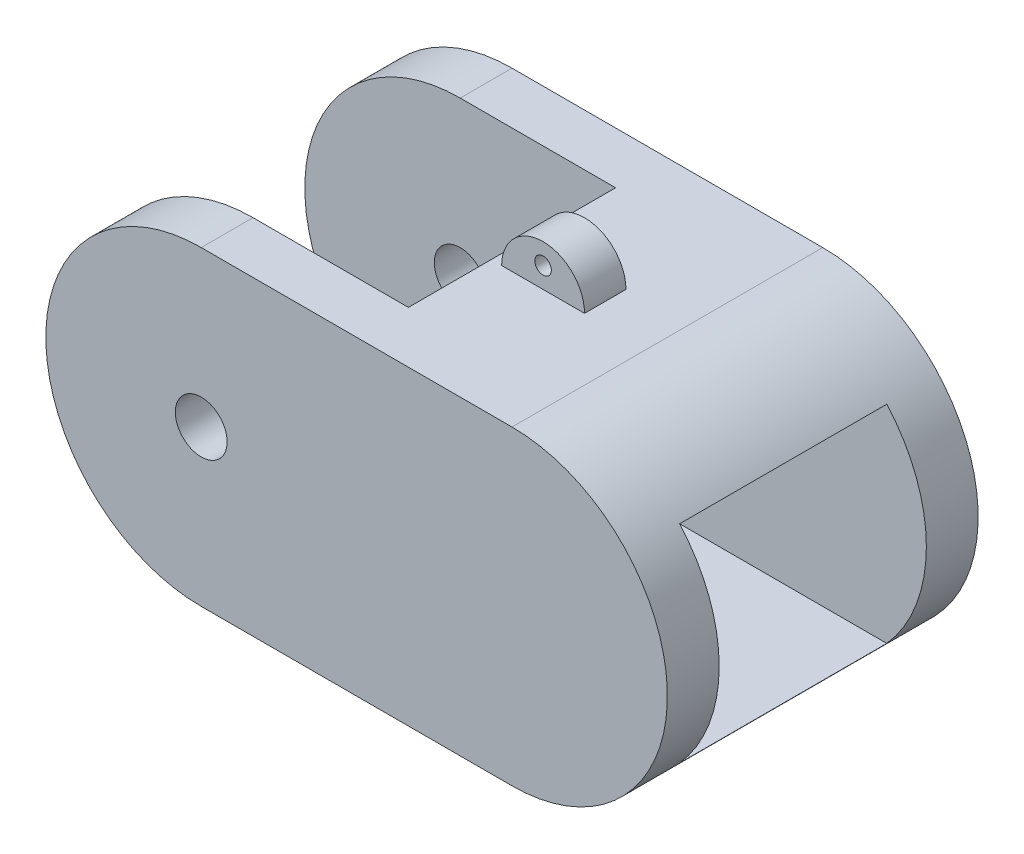
ISO-10303-21;
HEADER;
FILE_DESCRIPTION(('STEP AP214'),'2;1');
FILE_NAME('part.step','',(''),(''),'','','');
FILE_SCHEMA(('AUTOMOTIVE_DESIGN { 1 0 10303 214 1 1 1 1 }'));
ENDSEC;
DATA;
#1=APPLICATION_CONTEXT('core data for automotive mechanical design processes');
#2=APPLICATION_PROTOCOL_DEFINITION('international standard','automotive_design',2000,#1);
#3=PRODUCT_CONTEXT('',#1,'mechanical');
#4=PRODUCT('Part','Part','',(#3));
#5=PRODUCT_RELATED_PRODUCT_CATEGORY('part','',(#4));
#6=PRODUCT_DEFINITION_FORMATION('','',#4);
#7=PRODUCT_DEFINITION_CONTEXT('part definition',#1,'design');
#8=PRODUCT_DEFINITION('design','',#6,#7);
#9=PRODUCT_DEFINITION_SHAPE('','',#8);
#10=(LENGTH_UNIT() NAMED_UNIT(*) SI_UNIT(.MILLI.,.METRE.));
#11=(NAMED_UNIT(*) PLANE_ANGLE_UNIT() SI_UNIT($,.RADIAN.));
#12=(NAMED_UNIT(*) SI_UNIT($,.STERADIAN.) SOLID_ANGLE_UNIT());
#13=UNCERTAINTY_MEASURE_WITH_UNIT(LENGTH_MEASURE(1.E-05),#10,'distance_accuracy_value','');
#14=(GEOMETRIC_REPRESENTATION_CONTEXT(3) GLOBAL_UNCERTAINTY_ASSIGNED_CONTEXT((#13)) GLOBAL_UNIT_ASSIGNED_CONTEXT((#10,
#11,#12)) REPRESENTATION_CONTEXT('',''));
#15=CARTESIAN_POINT('',(0.,0.,0.));
#16=DIRECTION('',(0.,0.,1.));
#17=DIRECTION('',(1.,0.,0.));
#18=AXIS2_PLACEMENT_3D('',#15,#16,#17);
#19=CARTESIAN_POINT('',(-2.54,21.59,1.27));
#20=DIRECTION('',(0.,0.,-1.));
#21=DIRECTION('',(-1.,0.,0.));
#22=AXIS2_PLACEMENT_3D('',#19,#20,#21);
#23=PLANE('',#22);
#24=DIRECTION('',(1.,0.,0.));
#25=VECTOR('',#24,1.);
#26=CARTESIAN_POINT('',(-2.54,19.05,1.27));
#27=LINE('',#26,#25);
#28=CARTESIAN_POINT('',(-2.54,19.05,1.27));
#29=VERTEX_POINT('',#28);
#30=CARTESIAN_POINT('',(2.54,19.05,1.26999999999999));
#31=VERTEX_POINT('',#30);
#32=EDGE_CURVE('E322',#29,#31,#27,.T.);
#33=ORIENTED_EDGE('',*,*,#32,.T.);
#34=CARTESIAN_POINT('',(0.,19.05,1.27));
#35=DIRECTION('',(0.,0.,-1.));
#36=DIRECTION('',(-1.,0.,0.));
#37=AXIS2_PLACEMENT_3D('',#34,#35,#36);
#38=CIRCLE('',#37,2.54);
#39=EDGE_CURVE('E302',#31,#29,#38,.F.);
#40=ORIENTED_EDGE('',*,*,#39,.T.);
#41=EDGE_LOOP('',(#33,#40));
#42=FACE_BOUND('',#41,.T.);
#43=CARTESIAN_POINT('',(0.,20.32,1.27));
#44=DIRECTION('',(0.,0.,-1.));
#45=DIRECTION('',(-1.,0.,0.));
#46=AXIS2_PLACEMENT_3D('',#43,#44,#45);
#47=CIRCLE('',#46,0.508000000000001);
#48=CARTESIAN_POINT('',(-0.508000000000002,20.32,1.27));
#49=VERTEX_POINT('',#48);
#50=EDGE_CURVE('E301',#49,#49,#47,.T.);
#51=ORIENTED_EDGE('',*,*,#50,.T.);
#52=EDGE_LOOP('',(#51));
#53=FACE_BOUND('',#52,.T.);
#54=ADVANCED_FACE('F39',(#42,#53),#23,.F.);
#55=CARTESIAN_POINT('',(-2.54,21.59,-1.27));
#56=DIRECTION('',(0.,0.,1.));
#57=DIRECTION('',(1.,0.,0.));
#58=AXIS2_PLACEMENT_3D('',#55,#56,#57);
#59=PLANE('',#58);
#60=DIRECTION('',(-1.,0.,0.));
#61=VECTOR('',#60,1.);
#62=CARTESIAN_POINT('',(-2.54,19.05,-1.27));
#63=LINE('',#62,#61);
#64=CARTESIAN_POINT('',(2.54,19.05,-1.27));
#65=VERTEX_POINT('',#64);
#66=CARTESIAN_POINT('',(-2.54,19.05,-1.27));
#67=VERTEX_POINT('',#66);
#68=EDGE_CURVE('E327',#65,#67,#63,.T.);
#69=ORIENTED_EDGE('',*,*,#68,.T.);
#70=CARTESIAN_POINT('',(0.,19.05,-1.27));
#71=DIRECTION('',(0.,0.,1.));
#72=DIRECTION('',(1.,0.,0.));
#73=AXIS2_PLACEMENT_3D('',#70,#71,#72);
#74=CIRCLE('',#73,2.54);
#75=EDGE_CURVE('E310',#67,#65,#74,.F.);
#76=ORIENTED_EDGE('',*,*,#75,.T.);
#77=EDGE_LOOP('',(#69,#76));
#78=FACE_BOUND('',#77,.T.);
#79=CARTESIAN_POINT('',(0.,20.32,-1.27));
#80=DIRECTION('',(0.,0.,1.));
#81=DIRECTION('',(1.,0.,0.));
#82=AXIS2_PLACEMENT_3D('',#79,#80,#81);
#83=CIRCLE('',#82,0.508000000000001);
#84=CARTESIAN_POINT('',(0.508000000000001,20.32,-1.27));
#85=VERTEX_POINT('',#84);
#86=EDGE_CURVE('E298',#85,#85,#83,.T.);
#87=ORIENTED_EDGE('',*,*,#86,.T.);
#88=EDGE_LOOP('',(#87));
#89=FACE_BOUND('',#88,.T.);
#90=ADVANCED_FACE('F499',(#78,#89),#59,.F.);
#91=CARTESIAN_POINT('',(0.,19.05,0.));
#92=DIRECTION('',(0.,1.,0.));
#93=DIRECTION('',(0.,0.,1.));
#94=AXIS2_PLACEMENT_3D('',#91,#92,#93);
#95=PLANE('',#94);
#96=DIRECTION('',(-1.,0.,0.));
#97=VECTOR('',#96,1.);
#98=CARTESIAN_POINT('',(-12.7,19.05,-6.35));
#99=LINE('',#98,#97);
#100=CARTESIAN_POINT('',(-3.175,19.05,-6.35));
#101=VERTEX_POINT('',#100);
#102=CARTESIAN_POINT('',(-12.7,19.05,-6.35));
#103=VERTEX_POINT('',#102);
#104=EDGE_CURVE('E466',#101,#103,#99,.T.);
#105=ORIENTED_EDGE('',*,*,#104,.F.);
#106=DIRECTION('',(0.,0.,-1.));
#107=VECTOR('',#106,1.);
#108=CARTESIAN_POINT('',(-3.175,19.05,-6.35));
#109=LINE('',#108,#107);
#110=CARTESIAN_POINT('',(-3.175,19.05,6.34999999999999));
#111=VERTEX_POINT('',#110);
#112=EDGE_CURVE('E197',#111,#101,#109,.T.);
#113=ORIENTED_EDGE('',*,*,#112,.F.);
#114=DIRECTION('',(1.,0.,0.));
#115=VECTOR('',#114,1.);
#116=CARTESIAN_POINT('',(-12.7,19.05,6.34999999999999));
#117=LINE('',#116,#115);
#118=CARTESIAN_POINT('',(-12.7,19.05,6.34999999999999));
#119=VERTEX_POINT('',#118);
#120=EDGE_CURVE('E188',#119,#111,#117,.T.);
#121=ORIENTED_EDGE('',*,*,#120,.F.);
#122=DIRECTION('',(0.,0.,1.));
#123=VECTOR('',#122,1.);
#124=CARTESIAN_POINT('',(-12.7,19.05,-9.525));
#125=LINE('',#124,#123);
#126=CARTESIAN_POINT('',(-12.7,19.05,9.525));
#127=VERTEX_POINT('',#126);
#128=EDGE_CURVE('E194',#119,#127,#125,.T.);
#129=ORIENTED_EDGE('',*,*,#128,.T.);
#130=DIRECTION('',(1.,0.,0.));
#131=VECTOR('',#130,1.);
#132=CARTESIAN_POINT('',(-22.225,19.05,9.525));
#133=LINE('',#132,#131);
#134=CARTESIAN_POINT('',(6.35,19.05,9.525));
#135=VERTEX_POINT('',#134);
#136=EDGE_CURVE('E256',#127,#135,#133,.T.);
#137=ORIENTED_EDGE('',*,*,#136,.T.);
#138=DIRECTION('',(0.,0.,1.));
#139=VECTOR('',#138,1.);
#140=CARTESIAN_POINT('',(6.35,19.05,-9.525));
#141=LINE('',#140,#139);
#142=CARTESIAN_POINT('',(6.35,19.05,-9.525));
#143=VERTEX_POINT('',#142);
#144=EDGE_CURVE('E236',#143,#135,#141,.T.);
#145=ORIENTED_EDGE('',*,*,#144,.F.);
#146=DIRECTION('',(-1.,0.,0.));
#147=VECTOR('',#146,1.);
#148=CARTESIAN_POINT('',(-22.225,19.05,-9.525));
#149=LINE('',#148,#147);
#150=CARTESIAN_POINT('',(-12.7,19.05,-9.525));
#151=VERTEX_POINT('',#150);
#152=EDGE_CURVE('E259',#143,#151,#149,.T.);
#153=ORIENTED_EDGE('',*,*,#152,.T.);
#154=EDGE_CURVE('E219',#151,#103,#125,.T.);
#155=ORIENTED_EDGE('',*,*,#154,.T.);
#156=EDGE_LOOP('',(#105,#113,#121,#129,#137,#145,#153,#155));
#157=FACE_BOUND('',#156,.T.);
#158=ORIENTED_EDGE('',*,*,#32,.F.);
#159=DIRECTION('',(0.,0.,1.));
#160=VECTOR('',#159,1.);
#161=CARTESIAN_POINT('',(-2.54,19.05,-1.27));
#162=LINE('',#161,#160);
#163=EDGE_CURVE('E308',#67,#29,#162,.T.);
#164=ORIENTED_EDGE('',*,*,#163,.F.);
#165=ORIENTED_EDGE('',*,*,#68,.F.);
#166=DIRECTION('',(0.,0.,-1.));
#167=VECTOR('',#166,1.);
#168=CARTESIAN_POINT('',(2.54,19.05,-1.27));
#169=LINE('',#168,#167);
#170=EDGE_CURVE('E62',#31,#65,#169,.T.);
#171=ORIENTED_EDGE('',*,*,#170,.F.);
#172=EDGE_LOOP('',(#158,#164,#165,#171));
#173=FACE_BOUND('',#172,.T.);
#174=ADVANCED_FACE('F191',(#157,#173),#95,.T.);
#175=CARTESIAN_POINT('',(-6.35,-7.62,-1.90500000000001));
#176=DIRECTION('',(0.,0.,-1.));
#177=DIRECTION('',(-1.,0.,0.));
#178=AXIS2_PLACEMENT_3D('',#175,#176,#177);
#179=PLANE('',#178);
#180=CARTESIAN_POINT('',(-0.0861930186881812,-2.99485448456808,-1.90500000000001));
#181=DIRECTION('',(0.,0.,-1.));
#182=DIRECTION('',(-1.,0.,0.));
#183=AXIS2_PLACEMENT_3D('',#180,#181,#182);
#184=CIRCLE('',#183,4.34412957457592);
#185=CARTESIAN_POINT('',(-4.41362492439032,-2.614335283717,-1.90500000000002));
#186=VERTEX_POINT('',#185);
#187=CARTESIAN_POINT('',(-3.23298636699812,0.,-1.90500000000002));
#188=VERTEX_POINT('',#187);
#189=EDGE_CURVE('E367',#186,#188,#184,.T.);
#190=ORIENTED_EDGE('',*,*,#189,.F.);
#191=CARTESIAN_POINT('',(-2.26854868254507,-2.28495035036065,-1.90500000000001));
#192=DIRECTION('',(0.,0.,-1.));
#193=DIRECTION('',(-1.,0.,0.));
#194=AXIS2_PLACEMENT_3D('',#191,#192,#193);
#195=CIRCLE('',#194,2.17021808066635);
#196=CARTESIAN_POINT('',(-3.04450374837902,-4.31170644162021,-1.90500000000002));
#197=VERTEX_POINT('',#196);
#198=EDGE_CURVE('E370',#197,#186,#195,.T.);
#199=ORIENTED_EDGE('',*,*,#198,.F.);
#200=CARTESIAN_POINT('',(-3.3233412187691,-2.19000144979784,-1.90500000000001));
#201=DIRECTION('',(0.,0.,-1.));
#202=DIRECTION('',(-1.,0.,0.));
#203=AXIS2_PLACEMENT_3D('',#200,#201,#202);
#204=CIRCLE('',#203,2.13994915996094);
#205=CARTESIAN_POINT('',(-1.31460402965717,-2.92780719136958,-1.90500000000002));
#206=VERTEX_POINT('',#205);
#207=EDGE_CURVE('E373',#206,#197,#204,.T.);
#208=ORIENTED_EDGE('',*,*,#207,.F.);
#209=CARTESIAN_POINT('',(-1.96109230852822,-2.92882586705521,-1.90500000000001));
#210=DIRECTION('',(0.,0.,-1.));
#211=DIRECTION('',(-1.,0.,0.));
#212=AXIS2_PLACEMENT_3D('',#209,#210,#211);
#213=CIRCLE('',#212,0.646489081437423);
#214=CARTESIAN_POINT('',(-2.21183198517268,-2.33294186242509,-1.90500000000002));
#215=VERTEX_POINT('',#214);
#216=EDGE_CURVE('E376',#215,#206,#213,.T.);
#217=ORIENTED_EDGE('',*,*,#216,.F.);
#218=CARTESIAN_POINT('',(-2.0593410105954,-1.72984424301921,-1.90500000000001));
#219=DIRECTION('',(0.,0.,-1.));
#220=DIRECTION('',(-1.,0.,0.));
#221=AXIS2_PLACEMENT_3D('',#218,#219,#220);
#222=CIRCLE('',#221,0.622077355206385);
#223=CARTESIAN_POINT('',(-1.90685003601812,-1.12674662361332,-1.90500000000002));
#224=VERTEX_POINT('',#223);
#225=EDGE_CURVE('E379',#224,#215,#222,.F.);
#226=ORIENTED_EDGE('',*,*,#225,.F.);
#227=CARTESIAN_POINT('',(-1.81149307872842,-2.77193940872848,-1.90500000000001));
#228=DIRECTION('',(0.,0.,-1.));
#229=DIRECTION('',(-1.,0.,0.));
#230=AXIS2_PLACEMENT_3D('',#227,#228,#229);
#231=CIRCLE('',#230,1.64795395854936);
#232=CARTESIAN_POINT('',(-0.163539125899153,-2.77180210276902,-1.90500000000002));
#233=VERTEX_POINT('',#232);
#234=EDGE_CURVE('E382',#233,#224,#231,.F.);
#235=ORIENTED_EDGE('',*,*,#234,.F.);
#236=CARTESIAN_POINT('',(-3.15358954399178,-2.81445182249442,-1.90500000000001));
#237=DIRECTION('',(0.,0.,-1.));
#238=DIRECTION('',(-1.,0.,0.));
#239=AXIS2_PLACEMENT_3D('',#236,#237,#238);
#240=CIRCLE('',#239,2.99035457786005);
#241=CARTESIAN_POINT('',(-6.12706480359468,-3.13172990534612,-1.90500000000002));
#242=VERTEX_POINT('',#241);
#243=EDGE_CURVE('E336',#242,#233,#240,.F.);
#244=ORIENTED_EDGE('',*,*,#243,.F.);
#245=DIRECTION('',(0.0710062762211976,-0.997475868749314,0.));
#246=VECTOR('',#245,1.);
#247=CARTESIAN_POINT('',(-5.81029790139981,-7.58158078857746,-1.90500000000001));
#248=LINE('',#247,#246);
#249=CARTESIAN_POINT('',(-6.35,0.,-1.90500000000002));
#250=VERTEX_POINT('',#249);
#251=EDGE_CURVE('E364',#250,#242,#248,.T.);
#252=ORIENTED_EDGE('',*,*,#251,.F.);
#253=DIRECTION('',(-1.,0.,0.));
#254=VECTOR('',#253,1.);
#255=CARTESIAN_POINT('',(-6.35,0.,-1.90500000000001));
#256=LINE('',#255,#254);
#257=EDGE_CURVE('E393',#188,#250,#256,.T.);
#258=ORIENTED_EDGE('',*,*,#257,.F.);
#259=EDGE_LOOP('',(#190,#199,#208,#217,#226,#235,#244,#252,#258));
#260=FACE_BOUND('',#259,.T.);
#261=ADVANCED_FACE('F541',(#260),#179,.T.);
#262=CARTESIAN_POINT('',(-6.35,-7.62,1.90499999999999));
#263=DIRECTION('',(0.,0.,1.));
#264=DIRECTION('',(1.,0.,0.));
#265=AXIS2_PLACEMENT_3D('',#262,#263,#264);
#266=PLANE('',#265);
#267=CARTESIAN_POINT('',(-0.0861930186881812,-2.99485448456808,1.90499999999998));
#268=DIRECTION('',(0.,0.,1.));
#269=DIRECTION('',(1.,0.,0.));
#270=AXIS2_PLACEMENT_3D('',#267,#268,#269);
#271=CIRCLE('',#270,4.34412957457592);
#272=CARTESIAN_POINT('',(-3.23298636699812,0.,1.90499999999998));
#273=VERTEX_POINT('',#272);
#274=CARTESIAN_POINT('',(-4.41362492439032,-2.614335283717,1.90499999999998));
#275=VERTEX_POINT('',#274);
#276=EDGE_CURVE('E48',#273,#275,#271,.T.);
#277=ORIENTED_EDGE('',*,*,#276,.F.);
#278=DIRECTION('',(1.,0.,0.));
#279=VECTOR('',#278,1.);
#280=CARTESIAN_POINT('',(-6.35,0.,1.90499999999999));
#281=LINE('',#280,#279);
#282=CARTESIAN_POINT('',(-6.35,0.,1.90499999999998));
#283=VERTEX_POINT('',#282);
#284=EDGE_CURVE('E389',#283,#273,#281,.T.);
#285=ORIENTED_EDGE('',*,*,#284,.F.);
#286=DIRECTION('',(-0.0710062762211976,0.997475868749314,0.));
#287=VECTOR('',#286,1.);
#288=CARTESIAN_POINT('',(-5.81029790139981,-7.58158078857746,1.90499999999999));
#289=LINE('',#288,#287);
#290=CARTESIAN_POINT('',(-6.12706480359468,-3.13172990534612,1.90499999999998));
#291=VERTEX_POINT('',#290);
#292=EDGE_CURVE('E278',#291,#283,#289,.T.);
#293=ORIENTED_EDGE('',*,*,#292,.F.);
#294=CARTESIAN_POINT('',(-3.15358954399178,-2.81445182249442,1.90499999999998));
#295=DIRECTION('',(0.,0.,1.));
#296=DIRECTION('',(1.,0.,0.));
#297=AXIS2_PLACEMENT_3D('',#294,#295,#296);
#298=CIRCLE('',#297,2.99035457786005);
#299=CARTESIAN_POINT('',(-0.163539125899152,-2.77180210276902,1.90499999999998));
#300=VERTEX_POINT('',#299);
#301=EDGE_CURVE('E275',#300,#291,#298,.F.);
#302=ORIENTED_EDGE('',*,*,#301,.F.);
#303=CARTESIAN_POINT('',(-1.81149307872842,-2.77193940872848,1.90499999999998));
#304=DIRECTION('',(0.,0.,1.));
#305=DIRECTION('',(1.,0.,0.));
#306=AXIS2_PLACEMENT_3D('',#303,#304,#305);
#307=CIRCLE('',#306,1.64795395854936);
#308=CARTESIAN_POINT('',(-1.90685003601812,-1.12674662361332,1.90499999999998));
#309=VERTEX_POINT('',#308);
#310=EDGE_CURVE('E281',#309,#300,#307,.F.);
#311=ORIENTED_EDGE('',*,*,#310,.F.);
#312=CARTESIAN_POINT('',(-2.0593410105954,-1.72984424301921,1.90499999999998));
#313=DIRECTION('',(0.,0.,1.));
#314=DIRECTION('',(1.,0.,0.));
#315=AXIS2_PLACEMENT_3D('',#312,#313,#314);
#316=CIRCLE('',#315,0.622077355206385);
#317=CARTESIAN_POINT('',(-2.21183198517268,-2.33294186242509,1.90499999999998));
#318=VERTEX_POINT('',#317);
#319=EDGE_CURVE('E285',#318,#309,#316,.F.);
#320=ORIENTED_EDGE('',*,*,#319,.F.);
#321=CARTESIAN_POINT('',(-1.96109230852822,-2.92882586705521,1.90499999999998));
#322=DIRECTION('',(0.,0.,1.));
#323=DIRECTION('',(1.,0.,0.));
#324=AXIS2_PLACEMENT_3D('',#321,#322,#323);
#325=CIRCLE('',#324,0.646489081437423);
#326=CARTESIAN_POINT('',(-1.31460402965717,-2.92780719136958,1.90499999999998));
#327=VERTEX_POINT('',#326);
#328=EDGE_CURVE('E288',#327,#318,#325,.T.);
#329=ORIENTED_EDGE('',*,*,#328,.F.);
#330=CARTESIAN_POINT('',(-3.3233412187691,-2.19000144979784,1.90499999999998));
#331=DIRECTION('',(0.,0.,1.));
#332=DIRECTION('',(1.,0.,0.));
#333=AXIS2_PLACEMENT_3D('',#330,#331,#332);
#334=CIRCLE('',#333,2.13994915996094);
#335=CARTESIAN_POINT('',(-3.04450374837902,-4.31170644162021,1.90499999999998));
#336=VERTEX_POINT('',#335);
#337=EDGE_CURVE('E291',#336,#327,#334,.T.);
#338=ORIENTED_EDGE('',*,*,#337,.F.);
#339=CARTESIAN_POINT('',(-2.26854868254507,-2.28495035036065,1.90499999999998));
#340=DIRECTION('',(0.,0.,1.));
#341=DIRECTION('',(1.,0.,0.));
#342=AXIS2_PLACEMENT_3D('',#339,#340,#341);
#343=CIRCLE('',#342,2.17021808066635);
#344=EDGE_CURVE('E294',#275,#336,#343,.T.);
#345=ORIENTED_EDGE('',*,*,#344,.F.);
#346=EDGE_LOOP('',(#277,#285,#293,#302,#311,#320,#329,#338,#345));
#347=FACE_BOUND('',#346,.T.);
#348=ADVANCED_FACE('F544',(#347),#266,.T.);
#349=CARTESIAN_POINT('',(6.35,9.525,-9.525));
#350=DIRECTION('',(0.,0.,1.));
#351=DIRECTION('',(1.,0.,0.));
#352=AXIS2_PLACEMENT_3D('',#349,#350,#351);
#353=CYLINDRICAL_SURFACE('',#352,9.525);
#354=CARTESIAN_POINT('',(6.35,9.525,9.525));
#355=DIRECTION('',(0.,0.,-1.));
#356=DIRECTION('',(1.,0.,0.));
#357=AXIS2_PLACEMENT_3D('',#354,#355,#356);
#358=CIRCLE('',#357,9.525);
#359=CARTESIAN_POINT('',(6.35,0.,9.525));
#360=VERTEX_POINT('',#359);
#361=EDGE_CURVE('E237',#135,#360,#358,.T.);
#362=ORIENTED_EDGE('',*,*,#361,.T.);
#363=DIRECTION('',(0.,0.,1.));
#364=VECTOR('',#363,1.);
#365=CARTESIAN_POINT('',(6.35,0.,-9.525));
#366=LINE('',#365,#364);
#367=CARTESIAN_POINT('',(6.35,0.,-9.525));
#368=VERTEX_POINT('',#367);
#369=EDGE_CURVE('E241',#368,#360,#366,.T.);
#370=ORIENTED_EDGE('',*,*,#369,.F.);
#371=CARTESIAN_POINT('',(6.35,9.525,-9.525));
#372=DIRECTION('',(0.,0.,-1.));
#373=DIRECTION('',(1.,0.,0.));
#374=AXIS2_PLACEMENT_3D('',#371,#372,#373);
#375=CIRCLE('',#374,9.525);
#376=EDGE_CURVE('E232',#143,#368,#375,.T.);
#377=ORIENTED_EDGE('',*,*,#376,.F.);
#378=ORIENTED_EDGE('',*,*,#144,.T.);
#379=EDGE_LOOP('',(#362,#370,#377,#378));
#380=FACE_BOUND('',#379,.T.);
#381=CARTESIAN_POINT('',(6.35,9.525,-6.35));
#382=DIRECTION('',(0.,0.,1.));
#383=DIRECTION('',(0.,-1.,0.));
#384=AXIS2_PLACEMENT_3D('',#381,#382,#383);
#385=CIRCLE('',#384,9.525);
#386=CARTESIAN_POINT('',(13.4495158285618,3.175,-6.35));
#387=VERTEX_POINT('',#386);
#388=CARTESIAN_POINT('',(13.4495158285618,15.875,-6.35));
#389=VERTEX_POINT('',#388);
#390=EDGE_CURVE('E424',#387,#389,#385,.T.);
#391=ORIENTED_EDGE('',*,*,#390,.F.);
#392=DIRECTION('',(0.,0.,1.));
#393=VECTOR('',#392,1.);
#394=CARTESIAN_POINT('',(13.4495158285618,3.175,-9.525));
#395=LINE('',#394,#393);
#396=CARTESIAN_POINT('',(13.4495158285618,3.175,6.35));
#397=VERTEX_POINT('',#396);
#398=EDGE_CURVE('E414',#397,#387,#395,.F.);
#399=ORIENTED_EDGE('',*,*,#398,.F.);
#400=CARTESIAN_POINT('',(6.35,9.525,6.35));
#401=DIRECTION('',(0.,0.,-1.));
#402=DIRECTION('',(-1.,0.,0.));
#403=AXIS2_PLACEMENT_3D('',#400,#401,#402);
#404=CIRCLE('',#403,9.525);
#405=CARTESIAN_POINT('',(13.4495158285618,15.875,6.35));
#406=VERTEX_POINT('',#405);
#407=EDGE_CURVE('E420',#406,#397,#404,.T.);
#408=ORIENTED_EDGE('',*,*,#407,.F.);
#409=DIRECTION('',(0.,0.,1.));
#410=VECTOR('',#409,1.);
#411=CARTESIAN_POINT('',(13.4495158285618,15.875,-9.525));
#412=LINE('',#411,#410);
#413=EDGE_CURVE('E417',#389,#406,#412,.T.);
#414=ORIENTED_EDGE('',*,*,#413,.F.);
#415=EDGE_LOOP('',(#391,#399,#408,#414));
#416=FACE_BOUND('',#415,.T.);
#417=ADVANCED_FACE('F454',(#380,#416),#353,.T.);
#418=CARTESIAN_POINT('',(-12.7,9.525,-9.525));
#419=DIRECTION('',(0.,0.,1.));
#420=DIRECTION('',(1.,0.,0.));
#421=AXIS2_PLACEMENT_3D('',#418,#419,#420);
#422=CYLINDRICAL_SURFACE('',#421,1.5875);
#423=CARTESIAN_POINT('',(-12.7,9.525,-9.525));
#424=DIRECTION('',(0.,0.,1.));
#425=DIRECTION('',(1.,0.,0.));
#426=AXIS2_PLACEMENT_3D('',#423,#424,#425);
#427=CIRCLE('',#426,1.5875);
#428=CARTESIAN_POINT('',(-11.1125,9.525,-9.525));
#429=VERTEX_POINT('',#428);
#430=EDGE_CURVE('E248',#429,#429,#427,.T.);
#431=ORIENTED_EDGE('',*,*,#430,.F.);
#432=EDGE_LOOP('',(#431));
#433=FACE_BOUND('',#432,.T.);
#434=CARTESIAN_POINT('',(-12.7,9.525,-6.35));
#435=DIRECTION('',(0.,0.,-1.));
#436=DIRECTION('',(-1.,0.,0.));
#437=AXIS2_PLACEMENT_3D('',#434,#435,#436);
#438=CIRCLE('',#437,1.5875);
#439=CARTESIAN_POINT('',(-14.2875,9.525,-6.35));
#440=VERTEX_POINT('',#439);
#441=EDGE_CURVE('E271',#440,#440,#438,.F.);
#442=ORIENTED_EDGE('',*,*,#441,.T.);
#443=EDGE_LOOP('',(#442));
#444=FACE_BOUND('',#443,.T.);
#445=ADVANCED_FACE('F564',(#433,#444),#422,.F.);
#446=CARTESIAN_POINT('',(-12.7,9.525,9.525));
#447=DIRECTION('',(0.,0.,1.));
#448=DIRECTION('',(1.,0.,0.));
#449=AXIS2_PLACEMENT_3D('',#446,#447,#448);
#450=CIRCLE('',#449,1.5875);
#451=CARTESIAN_POINT('',(-11.1125,9.525,9.525));
#452=VERTEX_POINT('',#451);
#453=EDGE_CURVE('E225',#452,#452,#450,.T.);
#454=ORIENTED_EDGE('',*,*,#453,.T.);
#455=EDGE_LOOP('',(#454));
#456=FACE_BOUND('',#455,.T.);
#457=CARTESIAN_POINT('',(-12.7,9.525,6.35));
#458=DIRECTION('',(0.,0.,1.));
#459=DIRECTION('',(1.,0.,0.));
#460=AXIS2_PLACEMENT_3D('',#457,#458,#459);
#461=CIRCLE('',#460,1.5875);
#462=CARTESIAN_POINT('',(-11.1125,9.525,6.35));
#463=VERTEX_POINT('',#462);
#464=EDGE_CURVE('E263',#463,#463,#461,.F.);
#465=ORIENTED_EDGE('',*,*,#464,.T.);
#466=EDGE_LOOP('',(#465));
#467=FACE_BOUND('',#466,.T.);
#468=ADVANCED_FACE('F557',(#456,#467),#422,.F.);
#469=CARTESIAN_POINT('',(-12.7,0.,-6.35));
#470=DIRECTION('',(1.,0.,0.));
#471=DIRECTION('',(0.,0.,-1.));
#472=AXIS2_PLACEMENT_3D('',#469,#470,#471);
#473=PLANE('',#472);
#474=DIRECTION('',(0.,0.,1.));
#475=VECTOR('',#474,1.);
#476=CARTESIAN_POINT('',(-12.7,3.175,-6.35));
#477=LINE('',#476,#475);
#478=CARTESIAN_POINT('',(-12.7,3.175,-6.35));
#479=VERTEX_POINT('',#478);
#480=CARTESIAN_POINT('',(-12.7,3.175,6.35));
#481=VERTEX_POINT('',#480);
#482=EDGE_CURVE('E411',#479,#481,#477,.T.);
#483=ORIENTED_EDGE('',*,*,#482,.F.);
#484=DIRECTION('',(0.,1.,0.));
#485=VECTOR('',#484,1.);
#486=CARTESIAN_POINT('',(-12.7,0.,-6.35));
#487=LINE('',#486,#485);
#488=CARTESIAN_POINT('',(-12.7,0.,-6.35));
#489=VERTEX_POINT('',#488);
#490=EDGE_CURVE('E212',#489,#479,#487,.T.);
#491=ORIENTED_EDGE('',*,*,#490,.F.);
#492=DIRECTION('',(0.,0.,-1.));
#493=VECTOR('',#492,1.);
#494=CARTESIAN_POINT('',(-12.7,0.,-6.35));
#495=LINE('',#494,#493);
#496=CARTESIAN_POINT('',(-12.7,0.,6.35));
#497=VERTEX_POINT('',#496);
#498=EDGE_CURVE('E427',#497,#489,#495,.T.);
#499=ORIENTED_EDGE('',*,*,#498,.F.);
#500=DIRECTION('',(0.,1.,0.));
#501=VECTOR('',#500,1.);
#502=CARTESIAN_POINT('',(-12.7,0.,6.35));
#503=LINE('',#502,#501);
#504=EDGE_CURVE('E206',#497,#481,#503,.T.);
#505=ORIENTED_EDGE('',*,*,#504,.T.);
#506=EDGE_LOOP('',(#483,#491,#499,#505));
#507=FACE_BOUND('',#506,.T.);
#508=ADVANCED_FACE('F469',(#507),#473,.F.);
#509=CARTESIAN_POINT('',(-12.7,9.525,-9.525));
#510=DIRECTION('',(0.,0.,1.));
#511=DIRECTION('',(1.,0.,0.));
#512=AXIS2_PLACEMENT_3D('',#509,#510,#511);
#513=CYLINDRICAL_SURFACE('',#512,9.525);
#514=DIRECTION('',(0.,0.,1.));
#515=VECTOR('',#514,1.);
#516=CARTESIAN_POINT('',(-12.7,0.,-9.525));
#517=LINE('',#516,#515);
#518=CARTESIAN_POINT('',(-12.7,0.,-9.525));
#519=VERTEX_POINT('',#518);
#520=EDGE_CURVE('E220',#519,#489,#517,.T.);
#521=ORIENTED_EDGE('',*,*,#520,.T.);
#522=CARTESIAN_POINT('',(-12.7,9.525,-6.35));
#523=DIRECTION('',(0.,0.,-1.));
#524=DIRECTION('',(-1.,0.,0.));
#525=AXIS2_PLACEMENT_3D('',#522,#523,#524);
#526=CIRCLE('',#525,9.525);
#527=EDGE_CURVE('E211',#489,#103,#526,.T.);
#528=ORIENTED_EDGE('',*,*,#527,.T.);
#529=ORIENTED_EDGE('',*,*,#154,.F.);
#530=CARTESIAN_POINT('',(-12.7,9.525,-9.525));
#531=DIRECTION('',(0.,0.,-1.));
#532=DIRECTION('',(1.,0.,0.));
#533=AXIS2_PLACEMENT_3D('',#530,#531,#532);
#534=CIRCLE('',#533,9.525);
#535=EDGE_CURVE('E438',#519,#151,#534,.T.);
#536=ORIENTED_EDGE('',*,*,#535,.F.);
#537=EDGE_LOOP('',(#521,#528,#529,#536));
#538=FACE_BOUND('',#537,.T.);
#539=ADVANCED_FACE('F460',(#538),#513,.T.);
#540=CARTESIAN_POINT('',(0.,0.,0.));
#541=DIRECTION('',(0.,1.,0.));
#542=DIRECTION('',(0.,0.,1.));
#543=AXIS2_PLACEMENT_3D('',#540,#541,#542);
#544=PLANE('',#543);
#545=DIRECTION('',(0.,0.,1.));
#546=VECTOR('',#545,1.);
#547=CARTESIAN_POINT('',(-3.23298636699812,0.,-9.525));
#548=LINE('',#547,#546);
#549=EDGE_CURVE('E353',#188,#273,#548,.T.);
#550=ORIENTED_EDGE('',*,*,#549,.F.);
#551=ORIENTED_EDGE('',*,*,#257,.T.);
#552=DIRECTION('',(0.,0.,1.));
#553=VECTOR('',#552,1.);
#554=CARTESIAN_POINT('',(-6.35,0.,1.90499999999999));
#555=LINE('',#554,#553);
#556=EDGE_CURVE('E385',#250,#283,#555,.T.);
#557=ORIENTED_EDGE('',*,*,#556,.T.);
#558=ORIENTED_EDGE('',*,*,#284,.T.);
#559=EDGE_LOOP('',(#550,#551,#557,#558));
#560=FACE_BOUND('',#559,.T.);
#561=ORIENTED_EDGE('',*,*,#369,.T.);
#562=DIRECTION('',(1.,0.,0.));
#563=VECTOR('',#562,1.);
#564=CARTESIAN_POINT('',(-22.225,0.,9.525));
#565=LINE('',#564,#563);
#566=CARTESIAN_POINT('',(-12.7,0.,9.525));
#567=VERTEX_POINT('',#566);
#568=EDGE_CURVE('E252',#567,#360,#565,.T.);
#569=ORIENTED_EDGE('',*,*,#568,.F.);
#570=EDGE_CURVE('E227',#497,#567,#517,.T.);
#571=ORIENTED_EDGE('',*,*,#570,.F.);
#572=ORIENTED_EDGE('',*,*,#498,.T.);
#573=ORIENTED_EDGE('',*,*,#520,.F.);
#574=DIRECTION('',(-1.,0.,0.));
#575=VECTOR('',#574,1.);
#576=CARTESIAN_POINT('',(-22.225,0.,-9.525));
#577=LINE('',#576,#575);
#578=EDGE_CURVE('E260',#368,#519,#577,.T.);
#579=ORIENTED_EDGE('',*,*,#578,.F.);
#580=EDGE_LOOP('',(#561,#569,#571,#572,#573,#579));
#581=FACE_BOUND('',#580,.T.);
#582=ADVANCED_FACE('F450',(#560,#581),#544,.F.);
#583=CARTESIAN_POINT('',(-22.225,19.05,9.525));
#584=DIRECTION('',(0.,0.,-1.));
#585=DIRECTION('',(-1.,0.,0.));
#586=AXIS2_PLACEMENT_3D('',#583,#584,#585);
#587=PLANE('',#586);
#588=ORIENTED_EDGE('',*,*,#453,.F.);
#589=EDGE_LOOP('',(#588));
#590=FACE_BOUND('',#589,.T.);
#591=ORIENTED_EDGE('',*,*,#568,.T.);
#592=ORIENTED_EDGE('',*,*,#361,.F.);
#593=ORIENTED_EDGE('',*,*,#136,.F.);
#594=CARTESIAN_POINT('',(-12.7,9.525,9.525));
#595=DIRECTION('',(0.,0.,-1.));
#596=DIRECTION('',(1.,0.,0.));
#597=AXIS2_PLACEMENT_3D('',#594,#595,#596);
#598=CIRCLE('',#597,9.525);
#599=EDGE_CURVE('E216',#567,#127,#598,.T.);
#600=ORIENTED_EDGE('',*,*,#599,.F.);
#601=EDGE_LOOP('',(#591,#592,#593,#600));
#602=FACE_BOUND('',#601,.T.);
#603=ADVANCED_FACE('F41',(#590,#602),#587,.F.);
#604=CARTESIAN_POINT('',(-22.225,19.05,-9.525));
#605=DIRECTION('',(0.,0.,1.));
#606=DIRECTION('',(1.,0.,0.));
#607=AXIS2_PLACEMENT_3D('',#604,#605,#606);
#608=PLANE('',#607);
#609=ORIENTED_EDGE('',*,*,#430,.T.);
#610=EDGE_LOOP('',(#609));
#611=FACE_BOUND('',#610,.T.);
#612=ORIENTED_EDGE('',*,*,#152,.F.);
#613=ORIENTED_EDGE('',*,*,#376,.T.);
#614=ORIENTED_EDGE('',*,*,#578,.T.);
#615=ORIENTED_EDGE('',*,*,#535,.T.);
#616=EDGE_LOOP('',(#612,#613,#614,#615));
#617=FACE_BOUND('',#616,.T.);
#618=ADVANCED_FACE('F457',(#611,#617),#608,.F.);
#619=ORIENTED_EDGE('',*,*,#128,.F.);
#620=CARTESIAN_POINT('',(-12.7,9.525,6.35));
#621=DIRECTION('',(0.,0.,1.));
#622=DIRECTION('',(1.,0.,0.));
#623=AXIS2_PLACEMENT_3D('',#620,#621,#622);
#624=CIRCLE('',#623,9.525);
#625=EDGE_CURVE('E201',#119,#497,#624,.T.);
#626=ORIENTED_EDGE('',*,*,#625,.T.);
#627=ORIENTED_EDGE('',*,*,#570,.T.);
#628=ORIENTED_EDGE('',*,*,#599,.T.);
#629=EDGE_LOOP('',(#619,#626,#627,#628));
#630=FACE_BOUND('',#629,.T.);
#631=ADVANCED_FACE('F214',(#630),#513,.T.);
#632=CARTESIAN_POINT('',(-29.3200702227345,0.,-6.35));
#633=DIRECTION('',(0.,0.,-1.));
#634=DIRECTION('',(-1.,0.,0.));
#635=AXIS2_PLACEMENT_3D('',#632,#633,#634);
#636=PLANE('',#635);
#637=ORIENTED_EDGE('',*,*,#104,.T.);
#638=ORIENTED_EDGE('',*,*,#527,.F.);
#639=ORIENTED_EDGE('',*,*,#490,.T.);
#640=DIRECTION('',(-1.,0.,0.));
#641=VECTOR('',#640,1.);
#642=CARTESIAN_POINT('',(34.925,3.175,-6.35));
#643=LINE('',#642,#641);
#644=EDGE_CURVE('E397',#387,#479,#643,.T.);
#645=ORIENTED_EDGE('',*,*,#644,.F.);
#646=ORIENTED_EDGE('',*,*,#390,.T.);
#647=DIRECTION('',(-1.,0.,0.));
#648=VECTOR('',#647,1.);
#649=CARTESIAN_POINT('',(34.925,15.875,-6.35));
#650=LINE('',#649,#648);
#651=CARTESIAN_POINT('',(-3.175,15.875,-6.35));
#652=VERTEX_POINT('',#651);
#653=EDGE_CURVE('E407',#389,#652,#650,.T.);
#654=ORIENTED_EDGE('',*,*,#653,.T.);
#655=DIRECTION('',(0.,1.,0.));
#656=VECTOR('',#655,1.);
#657=CARTESIAN_POINT('',(-3.175,15.24,-6.35));
#658=LINE('',#657,#656);
#659=EDGE_CURVE('E316',#652,#101,#658,.T.);
#660=ORIENTED_EDGE('',*,*,#659,.T.);
#661=EDGE_LOOP('',(#637,#638,#639,#645,#646,#654,#660));
#662=FACE_BOUND('',#661,.T.);
#663=ORIENTED_EDGE('',*,*,#441,.F.);
#664=EDGE_LOOP('',(#663));
#665=FACE_BOUND('',#664,.T.);
#666=ADVANCED_FACE('F463',(#662,#665),#636,.F.);
#667=CARTESIAN_POINT('',(-29.3200702227345,0.,6.35));
#668=DIRECTION('',(0.,0.,1.));
#669=DIRECTION('',(1.,0.,0.));
#670=AXIS2_PLACEMENT_3D('',#667,#668,#669);
#671=PLANE('',#670);
#672=ORIENTED_EDGE('',*,*,#625,.F.);
#673=ORIENTED_EDGE('',*,*,#120,.T.);
#674=DIRECTION('',(0.,1.,0.));
#675=VECTOR('',#674,1.);
#676=CARTESIAN_POINT('',(-3.175,15.24,6.34999999999999));
#677=LINE('',#676,#675);
#678=CARTESIAN_POINT('',(-3.175,15.875,6.35));
#679=VERTEX_POINT('',#678);
#680=EDGE_CURVE('E55',#679,#111,#677,.T.);
#681=ORIENTED_EDGE('',*,*,#680,.F.);
#682=DIRECTION('',(-1.,0.,0.));
#683=VECTOR('',#682,1.);
#684=CARTESIAN_POINT('',(34.925,15.875,6.35));
#685=LINE('',#684,#683);
#686=EDGE_CURVE('E403',#406,#679,#685,.T.);
#687=ORIENTED_EDGE('',*,*,#686,.F.);
#688=ORIENTED_EDGE('',*,*,#407,.T.);
#689=DIRECTION('',(-1.,0.,0.));
#690=VECTOR('',#689,1.);
#691=CARTESIAN_POINT('',(34.925,3.175,6.35));
#692=LINE('',#691,#690);
#693=EDGE_CURVE('E400',#397,#481,#692,.T.);
#694=ORIENTED_EDGE('',*,*,#693,.T.);
#695=ORIENTED_EDGE('',*,*,#504,.F.);
#696=EDGE_LOOP('',(#672,#673,#681,#687,#688,#694,#695));
#697=FACE_BOUND('',#696,.T.);
#698=ORIENTED_EDGE('',*,*,#464,.F.);
#699=EDGE_LOOP('',(#698));
#700=FACE_BOUND('',#699,.T.);
#701=ADVANCED_FACE('F202',(#697,#700),#671,.F.);
#702=CARTESIAN_POINT('',(34.925,15.875,-6.35));
#703=DIRECTION('',(0.,-1.,0.));
#704=DIRECTION('',(0.,0.,-1.));
#705=AXIS2_PLACEMENT_3D('',#702,#703,#704);
#706=PLANE('',#705);
#707=DIRECTION('',(0.,0.,1.));
#708=VECTOR('',#707,1.);
#709=CARTESIAN_POINT('',(-3.175,15.875,-6.35));
#710=LINE('',#709,#708);
#711=EDGE_CURVE('E11',#652,#679,#710,.T.);
#712=ORIENTED_EDGE('',*,*,#711,.F.);
#713=ORIENTED_EDGE('',*,*,#653,.F.);
#714=ORIENTED_EDGE('',*,*,#413,.T.);
#715=ORIENTED_EDGE('',*,*,#686,.T.);
#716=EDGE_LOOP('',(#712,#713,#714,#715));
#717=FACE_BOUND('',#716,.T.);
#718=ADVANCED_FACE('F479',(#717),#706,.T.);
#719=CARTESIAN_POINT('',(34.925,3.175,-6.35));
#720=DIRECTION('',(0.,1.,0.));
#721=DIRECTION('',(0.,0.,1.));
#722=AXIS2_PLACEMENT_3D('',#719,#720,#721);
#723=PLANE('',#722);
#724=ORIENTED_EDGE('',*,*,#398,.T.);
#725=ORIENTED_EDGE('',*,*,#644,.T.);
#726=ORIENTED_EDGE('',*,*,#482,.T.);
#727=ORIENTED_EDGE('',*,*,#693,.F.);
#728=EDGE_LOOP('',(#724,#725,#726,#727));
#729=FACE_BOUND('',#728,.T.);
#730=ADVANCED_FACE('F471',(#729),#723,.T.);
#731=CARTESIAN_POINT('',(-1.81149307872842,-2.77193940872848,-9.525));
#732=DIRECTION('',(0.,0.,1.));
#733=DIRECTION('',(1.,0.,0.));
#734=AXIS2_PLACEMENT_3D('',#731,#732,#733);
#735=CYLINDRICAL_SURFACE('',#734,1.64795395854936);
#736=ORIENTED_EDGE('',*,*,#234,.T.);
#737=DIRECTION('',(0.,0.,1.));
#738=VECTOR('',#737,1.);
#739=CARTESIAN_POINT('',(-1.90685003601812,-1.12674662361332,-9.525));
#740=LINE('',#739,#738);
#741=EDGE_CURVE('E332',#224,#309,#740,.T.);
#742=ORIENTED_EDGE('',*,*,#741,.T.);
#743=ORIENTED_EDGE('',*,*,#310,.T.);
#744=DIRECTION('',(0.,0.,1.));
#745=VECTOR('',#744,1.);
#746=CARTESIAN_POINT('',(-0.163539125899153,-2.77180210276902,-9.525));
#747=LINE('',#746,#745);
#748=EDGE_CURVE('E331',#233,#300,#747,.T.);
#749=ORIENTED_EDGE('',*,*,#748,.F.);
#750=EDGE_LOOP('',(#736,#742,#743,#749));
#751=FACE_BOUND('',#750,.T.);
#752=ADVANCED_FACE('F513',(#751),#735,.T.);
#753=CARTESIAN_POINT('',(-2.0593410105954,-1.72984424301921,-9.525));
#754=DIRECTION('',(0.,0.,1.));
#755=DIRECTION('',(1.,0.,0.));
#756=AXIS2_PLACEMENT_3D('',#753,#754,#755);
#757=CYLINDRICAL_SURFACE('',#756,0.622077355206385);
#758=ORIENTED_EDGE('',*,*,#225,.T.);
#759=DIRECTION('',(0.,0.,1.));
#760=VECTOR('',#759,1.);
#761=CARTESIAN_POINT('',(-2.21183198517268,-2.33294186242509,-9.525));
#762=LINE('',#761,#760);
#763=EDGE_CURVE('E337',#215,#318,#762,.T.);
#764=ORIENTED_EDGE('',*,*,#763,.T.);
#765=ORIENTED_EDGE('',*,*,#319,.T.);
#766=ORIENTED_EDGE('',*,*,#741,.F.);
#767=EDGE_LOOP('',(#758,#764,#765,#766));
#768=FACE_BOUND('',#767,.T.);
#769=ADVANCED_FACE('F509',(#768),#757,.T.);
#770=CARTESIAN_POINT('',(-1.96109230852822,-2.92882586705521,-9.525));
#771=DIRECTION('',(0.,0.,1.));
#772=DIRECTION('',(1.,0.,0.));
#773=AXIS2_PLACEMENT_3D('',#770,#771,#772);
#774=CYLINDRICAL_SURFACE('',#773,0.646489081437423);
#775=ORIENTED_EDGE('',*,*,#216,.T.);
#776=DIRECTION('',(0.,0.,1.));
#777=VECTOR('',#776,1.);
#778=CARTESIAN_POINT('',(-1.31460402965717,-2.92780719136958,-9.525));
#779=LINE('',#778,#777);
#780=EDGE_CURVE('E341',#206,#327,#779,.T.);
#781=ORIENTED_EDGE('',*,*,#780,.T.);
#782=ORIENTED_EDGE('',*,*,#328,.T.);
#783=ORIENTED_EDGE('',*,*,#763,.F.);
#784=EDGE_LOOP('',(#775,#781,#782,#783));
#785=FACE_BOUND('',#784,.T.);
#786=ADVANCED_FACE('F512',(#785),#774,.F.);
#787=CARTESIAN_POINT('',(-3.3233412187691,-2.19000144979784,-9.525));
#788=DIRECTION('',(0.,0.,1.));
#789=DIRECTION('',(1.,0.,0.));
#790=AXIS2_PLACEMENT_3D('',#787,#788,#789);
#791=CYLINDRICAL_SURFACE('',#790,2.13994915996094);
#792=ORIENTED_EDGE('',*,*,#207,.T.);
#793=DIRECTION('',(0.,0.,1.));
#794=VECTOR('',#793,1.);
#795=CARTESIAN_POINT('',(-3.04450374837902,-4.31170644162021,-9.525));
#796=LINE('',#795,#794);
#797=EDGE_CURVE('E345',#197,#336,#796,.T.);
#798=ORIENTED_EDGE('',*,*,#797,.T.);
#799=ORIENTED_EDGE('',*,*,#337,.T.);
#800=ORIENTED_EDGE('',*,*,#780,.F.);
#801=EDGE_LOOP('',(#792,#798,#799,#800));
#802=FACE_BOUND('',#801,.T.);
#803=ADVANCED_FACE('F517',(#802),#791,.F.);
#804=CARTESIAN_POINT('',(-2.26854868254507,-2.28495035036065,-9.525));
#805=DIRECTION('',(0.,0.,1.));
#806=DIRECTION('',(1.,0.,0.));
#807=AXIS2_PLACEMENT_3D('',#804,#805,#806);
#808=CYLINDRICAL_SURFACE('',#807,2.17021808066635);
#809=ORIENTED_EDGE('',*,*,#198,.T.);
#810=DIRECTION('',(0.,0.,1.));
#811=VECTOR('',#810,1.);
#812=CARTESIAN_POINT('',(-4.41362492439032,-2.614335283717,-9.525));
#813=LINE('',#812,#811);
#814=EDGE_CURVE('E349',#186,#275,#813,.T.);
#815=ORIENTED_EDGE('',*,*,#814,.T.);
#816=ORIENTED_EDGE('',*,*,#344,.T.);
#817=ORIENTED_EDGE('',*,*,#797,.F.);
#818=EDGE_LOOP('',(#809,#815,#816,#817));
#819=FACE_BOUND('',#818,.T.);
#820=ADVANCED_FACE('F521',(#819),#808,.F.);
#821=CARTESIAN_POINT('',(-0.0861930186881812,-2.99485448456808,-9.525));
#822=DIRECTION('',(0.,0.,1.));
#823=DIRECTION('',(1.,0.,0.));
#824=AXIS2_PLACEMENT_3D('',#821,#822,#823);
#825=CYLINDRICAL_SURFACE('',#824,4.34412957457592);
#826=ORIENTED_EDGE('',*,*,#189,.T.);
#827=ORIENTED_EDGE('',*,*,#549,.T.);
#828=ORIENTED_EDGE('',*,*,#276,.T.);
#829=ORIENTED_EDGE('',*,*,#814,.F.);
#830=EDGE_LOOP('',(#826,#827,#828,#829));
#831=FACE_BOUND('',#830,.T.);
#832=ADVANCED_FACE('F525',(#831),#825,.F.);
#833=CARTESIAN_POINT('',(-6.12706480359469,-3.13172990534612,-9.525));
#834=DIRECTION('',(0.997475868749314,0.0710062762211976,0.));
#835=DIRECTION('',(-0.0710062762211976,0.997475868749314,0.));
#836=AXIS2_PLACEMENT_3D('',#833,#834,#835);
#837=PLANE('',#836);
#838=ORIENTED_EDGE('',*,*,#251,.T.);
#839=DIRECTION('',(0.,0.,1.));
#840=VECTOR('',#839,1.);
#841=CARTESIAN_POINT('',(-6.12706480359468,-3.13172990534612,-9.525));
#842=LINE('',#841,#840);
#843=EDGE_CURVE('E356',#242,#291,#842,.T.);
#844=ORIENTED_EDGE('',*,*,#843,.T.);
#845=ORIENTED_EDGE('',*,*,#292,.T.);
#846=ORIENTED_EDGE('',*,*,#556,.F.);
#847=EDGE_LOOP('',(#838,#844,#845,#846));
#848=FACE_BOUND('',#847,.T.);
#849=ADVANCED_FACE('F529',(#848),#837,.F.);
#850=CARTESIAN_POINT('',(-3.15358954399178,-2.81445182249442,-9.525));
#851=DIRECTION('',(0.,0.,1.));
#852=DIRECTION('',(1.,0.,0.));
#853=AXIS2_PLACEMENT_3D('',#850,#851,#852);
#854=CYLINDRICAL_SURFACE('',#853,2.99035457786005);
#855=ORIENTED_EDGE('',*,*,#243,.T.);
#856=ORIENTED_EDGE('',*,*,#748,.T.);
#857=ORIENTED_EDGE('',*,*,#301,.T.);
#858=ORIENTED_EDGE('',*,*,#843,.F.);
#859=EDGE_LOOP('',(#855,#856,#857,#858));
#860=FACE_BOUND('',#859,.T.);
#861=ADVANCED_FACE('F533',(#860),#854,.T.);
#862=CARTESIAN_POINT('',(0.,19.05,-9.525));
#863=DIRECTION('',(0.,0.,1.));
#864=DIRECTION('',(1.,0.,0.));
#865=AXIS2_PLACEMENT_3D('',#862,#863,#864);
#866=CYLINDRICAL_SURFACE('',#865,2.54);
#867=ORIENTED_EDGE('',*,*,#170,.T.);
#868=ORIENTED_EDGE('',*,*,#75,.F.);
#869=ORIENTED_EDGE('',*,*,#163,.T.);
#870=ORIENTED_EDGE('',*,*,#39,.F.);
#871=EDGE_LOOP('',(#867,#868,#869,#870));
#872=FACE_BOUND('',#871,.T.);
#873=ADVANCED_FACE('F495',(#872),#866,.T.);
#874=CARTESIAN_POINT('',(0.,20.32,-9.525));
#875=DIRECTION('',(0.,0.,1.));
#876=DIRECTION('',(1.,0.,0.));
#877=AXIS2_PLACEMENT_3D('',#874,#875,#876);
#878=CYLINDRICAL_SURFACE('',#877,0.508000000000001);
#879=ORIENTED_EDGE('',*,*,#86,.F.);
#880=EDGE_LOOP('',(#879));
#881=FACE_BOUND('',#880,.T.);
#882=ORIENTED_EDGE('',*,*,#50,.F.);
#883=EDGE_LOOP('',(#882));
#884=FACE_BOUND('',#883,.T.);
#885=ADVANCED_FACE('F490',(#881,#884),#878,.F.);
#886=CARTESIAN_POINT('',(-3.175,15.24,-6.35));
#887=DIRECTION('',(1.,0.,0.));
#888=DIRECTION('',(0.,0.,-1.));
#889=AXIS2_PLACEMENT_3D('',#886,#887,#888);
#890=PLANE('',#889);
#891=ORIENTED_EDGE('',*,*,#711,.T.);
#892=ORIENTED_EDGE('',*,*,#680,.T.);
#893=ORIENTED_EDGE('',*,*,#112,.T.);
#894=ORIENTED_EDGE('',*,*,#659,.F.);
#895=EDGE_LOOP('',(#891,#892,#893,#894));
#896=FACE_BOUND('',#895,.T.);
#897=ADVANCED_FACE('F481',(#896),#890,.F.);
#898=CLOSED_SHELL('',(#54,#90,#174,#261,#348,#417,#445,#468,#508,#539,#582,#603,#618,#631,#666,
#701,#718,#730,#752,#769,#786,#803,#820,#832,#849,#861,#873,#885,#897));
#899=MANIFOLD_SOLID_BREP('B2',#898);
#900=ADVANCED_BREP_SHAPE_REPRESENTATION('',(#18,#899),#14);
#901=SHAPE_DEFINITION_REPRESENTATION(#9,#900);
ENDSEC;
END-ISO-10303-21;
